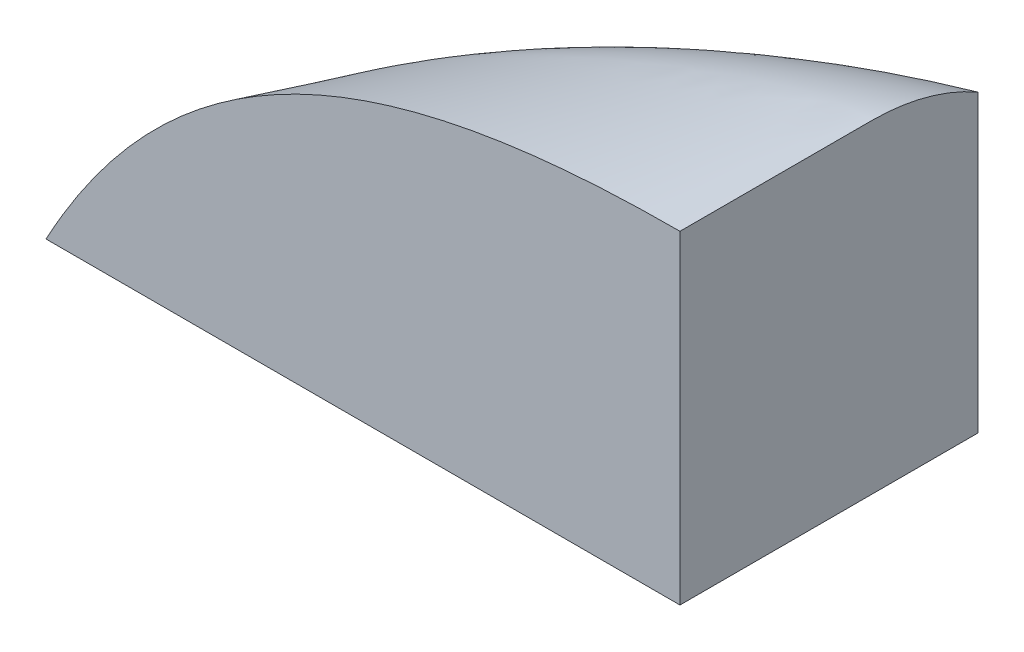
ISO-10303-21;
HEADER;
FILE_DESCRIPTION(('STEP AP214'),'2;1');
FILE_NAME('part.step','',(''),(''),'','','');
FILE_SCHEMA(('AUTOMOTIVE_DESIGN { 1 0 10303 214 1 1 1 1 }'));
ENDSEC;
DATA;
#1=APPLICATION_CONTEXT('core data for automotive mechanical design processes');
#2=APPLICATION_PROTOCOL_DEFINITION('international standard','automotive_design',2000,#1);
#3=PRODUCT_CONTEXT('',#1,'mechanical');
#4=PRODUCT('Part','Part','',(#3));
#5=PRODUCT_RELATED_PRODUCT_CATEGORY('part','',(#4));
#6=PRODUCT_DEFINITION_FORMATION('','',#4);
#7=PRODUCT_DEFINITION_CONTEXT('part definition',#1,'design');
#8=PRODUCT_DEFINITION('design','',#6,#7);
#9=PRODUCT_DEFINITION_SHAPE('','',#8);
#10=(LENGTH_UNIT() NAMED_UNIT(*) SI_UNIT(.MILLI.,.METRE.));
#11=(NAMED_UNIT(*) PLANE_ANGLE_UNIT() SI_UNIT($,.RADIAN.));
#12=(NAMED_UNIT(*) SI_UNIT($,.STERADIAN.) SOLID_ANGLE_UNIT());
#13=UNCERTAINTY_MEASURE_WITH_UNIT(LENGTH_MEASURE(1.E-05),#10,'distance_accuracy_value','');
#14=(GEOMETRIC_REPRESENTATION_CONTEXT(3) GLOBAL_UNCERTAINTY_ASSIGNED_CONTEXT((#13)) GLOBAL_UNIT_ASSIGNED_CONTEXT((#10,
#11,#12)) REPRESENTATION_CONTEXT('',''));
#15=CARTESIAN_POINT('',(0.,0.,0.));
#16=DIRECTION('',(0.,0.,1.));
#17=DIRECTION('',(1.,0.,0.));
#18=AXIS2_PLACEMENT_3D('',#15,#16,#17);
#19=CARTESIAN_POINT('',(-82.9999999999987,46.9999999999978,-104.499999999999));
#20=CARTESIAN_POINT('',(-82.9999999999965,81.4999999999957,-104.499999999672));
#21=CARTESIAN_POINT('',(-82.9999999999965,115.999999999994,-104.499999999621));
#22=CARTESIAN_POINT('',(-82.9999999999965,150.499999999992,-104.49999999957));
#23=CARTESIAN_POINT('',(-173.829365727021,46.9999999999978,-104.499999999999));
#24=CARTESIAN_POINT('',(-175.939901268627,76.2160672193664,-98.7768367889955));
#25=CARTESIAN_POINT('',(-178.050436810234,105.432134438735,-93.0536735781759));
#26=CARTESIAN_POINT('',(-180.160972351841,134.648201658104,-87.3305103673561));
#27=CARTESIAN_POINT('',(-255.676900743604,46.9999999999978,-73.6809860932464));
#28=CARTESIAN_POINT('',(-256.370700136172,66.3103367095811,-67.2982648366521));
#29=CARTESIAN_POINT('',(-257.064499528741,85.6206734191644,-60.9155435801496));
#30=CARTESIAN_POINT('',(-257.758298921309,104.931010128748,-54.532822323647));
#31=CARTESIAN_POINT('',(-305.09168004145,46.9999999999978,1.45455479258483E-11));
#32=CARTESIAN_POINT('',(-305.255585793366,46.7535479957056,1.21556949659459E-11));
#33=CARTESIAN_POINT('',(-305.419491545282,46.5070959914134,9.76584200604345E-12));
#34=CARTESIAN_POINT('',(-305.583397297199,46.2606439871212,7.37598904614104E-12));
#35=B_SPLINE_SURFACE_WITH_KNOTS('',3,3,((#19,#20,#21,#22),(#23,#24,#25,#26),(#27,#28,#29,#30),
(#31,#32,#33,#34)),.UNSPECIFIED.,.F.,.F.,.F.,(4,4),(4,4),(0.,1.),(0.,0.492904008584408),.UNSPECIFIED.);
#36=CARTESIAN_POINT('',(-82.9999999999987,46.9999999999978,-104.499999999999));
#37=CARTESIAN_POINT('',(-173.829365727021,46.9999999999978,-104.499999999999));
#38=CARTESIAN_POINT('',(-255.676900743604,46.9999999999978,-73.6809860932464));
#39=CARTESIAN_POINT('',(-305.09168004145,46.9999999999978,1.45455479258483E-11));
#40=B_SPLINE_CURVE_WITH_KNOTS('',3,(#36,#37,#38,#39),.UNSPECIFIED.,.F.,.F.,(4,4),(0.,1.),.UNSPECIFIED.);
#41=CARTESIAN_POINT('',(-82.9999999999987,46.9999999999978,-104.499999999999));
#42=VERTEX_POINT('',#41);
#43=CARTESIAN_POINT('',(-304.465944132718,46.9999999999978,-0.928171718992609));
#44=VERTEX_POINT('',#43);
#45=EDGE_CURVE('E104',#42,#44,#40,.T.);
#46=CARTESIAN_POINT('',(-304.465944132718,46.9999999999978,-0.928171718992609));
#47=CARTESIAN_POINT('',(-304.487274645418,46.9999999999978,-0.918143305819814));
#48=CARTESIAN_POINT('',(-304.508605158118,46.9999999999999,-0.908114892646524));
#49=CARTESIAN_POINT('',(-304.551266183517,47.0000000000082,-0.88805806629863));
#50=CARTESIAN_POINT('',(-304.572596696217,47.0000000000144,-0.878029653124026));
#51=CARTESIAN_POINT('',(-304.615257721617,47.000000000031,-0.857972826773481));
#52=CARTESIAN_POINT('',(-304.636588234317,47.0000000000414,-0.84794441359754));
#53=CARTESIAN_POINT('',(-304.679249259717,47.0000000000662,-0.827887587244356));
#54=CARTESIAN_POINT('',(-304.700579772417,47.0000000000807,-0.817859174067112));
#55=CARTESIAN_POINT('',(-304.743240797818,47.0000000001139,-0.797802347711282));
#56=CARTESIAN_POINT('',(-304.764571310518,47.0000000001325,-0.787773934532695));
#57=CARTESIAN_POINT('',(-304.807232335918,47.000000000174,-0.767717108174197));
#58=CARTESIAN_POINT('',(-304.828562848619,47.0000000001968,-0.757688694994286));
#59=CARTESIAN_POINT('',(-304.87122387402,47.0000000002465,-0.737631868633129));
#60=CARTESIAN_POINT('',(-304.89255438672,47.0000000002735,-0.727603455451884));
#61=CARTESIAN_POINT('',(-304.935215412121,47.0000000003315,-0.707546629088053));
#62=CARTESIAN_POINT('',(-304.956545924822,47.0000000003626,-0.697518215905466));
#63=CARTESIAN_POINT('',(-304.977876437522,47.0000000003957,-0.687489802722338));
#64=B_SPLINE_CURVE_WITH_KNOTS('',3,(#46,#47,#48,#49,#50,#51,#52,#53,#54,#55,#56,#57,#58,#59,#60,
#61,#62,#63),.UNSPECIFIED.,.F.,.F.,(4,2,2,2,2,2,2,2,4),(0.,0.0707109509572579,0.141421901916545,
0.212132852877766,0.282843803841187,0.353554754806445,0.424265705773704,0.494976656743022,
0.565687607714302),.UNSPECIFIED.);
#65=CARTESIAN_POINT('',(-304.977876437522,47.0000000003958,-0.687489802722374));
#66=VERTEX_POINT('',#65);
#67=EDGE_CURVE('E102',#44,#66,#64,.T.);
#68=CARTESIAN_POINT('',(-82.9999999999965,150.499999999992,-104.49999999957));
#69=CARTESIAN_POINT('',(-180.160972351841,134.648201658104,-87.3305103673561));
#70=CARTESIAN_POINT('',(-257.758298921309,104.931010128748,-54.532822323647));
#71=CARTESIAN_POINT('',(-305.583397297199,46.2606439871212,7.37598904614104E-12));
#72=B_SPLINE_CURVE_WITH_KNOTS('',3,(#68,#69,#70,#71),.UNSPECIFIED.,.F.,.F.,(4,4),(0.,1.),.UNSPECIFIED.);
#73=CARTESIAN_POINT('',(-82.9999999999965,150.499999999992,-104.49999999957));
#74=VERTEX_POINT('',#73);
#75=EDGE_CURVE('E87',#74,#66,#72,.T.);
#76=DIRECTION('',(0.,1.,9.46143324717752E-12));
#77=VECTOR('',#76,1.);
#78=CARTESIAN_POINT('',(-82.9999999999968,98.7499999999947,-104.499999999681));
#79=LINE('',#78,#77);
#80=EDGE_CURVE('E92',#42,#74,#79,.T.);
#81=ORIENTED_EDGE('',*,*,#45,.T.);
#82=ORIENTED_EDGE('',*,*,#67,.T.);
#83=ORIENTED_EDGE('',*,*,#75,.F.);
#84=ORIENTED_EDGE('',*,*,#80,.F.);
#85=EDGE_LOOP('',(#81,#82,#83,#84));
#86=FACE_BOUND('',#85,.T.);
#87=ADVANCED_FACE('F43',(#86),#35,.T.);
#88=CARTESIAN_POINT('',(-82.9999999999965,150.499999999992,-104.49999999957));
#89=CARTESIAN_POINT('',(-82.9999999999965,157.051493564003,-93.1187580086268));
#90=CARTESIAN_POINT('',(-82.9999999999965,160.499999999992,-80.2156284290725));
#91=CARTESIAN_POINT('',(-82.9999999999964,160.499999999992,-44.7222840878865));
#92=CARTESIAN_POINT('',(-82.9999999999965,160.499999999992,-22.3611420439435));
#93=CARTESIAN_POINT('',(-82.9999999999987,160.499999999996,0.));
#94=CARTESIAN_POINT('',(-180.160972351841,134.648201658104,-87.3305103673561));
#95=CARTESIAN_POINT('',(-180.964334081925,141.381969895503,-77.5645305744326));
#96=CARTESIAN_POINT('',(-181.767695812009,146.047080047554,-66.7839590557682));
#97=CARTESIAN_POINT('',(-183.938999137301,152.442123939295,-37.2337815946521));
#98=CARTESIAN_POINT('',(-185.306940732509,156.471061969644,-18.6168907973262));
#99=CARTESIAN_POINT('',(-186.674882327718,160.499999999996,0.));
#100=CARTESIAN_POINT('',(-257.758298921309,104.931010128748,-54.532822323647));
#101=CARTESIAN_POINT('',(-258.02238918151,110.087795568341,-48.3095333484898));
#102=CARTESIAN_POINT('',(-258.28647944171,114.21025196526,-41.5789485104622));
#103=CARTESIAN_POINT('',(-259.000255115454,122.245468494358,-23.1813373999145));
#104=CARTESIAN_POINT('',(-259.449940528996,127.307730771866,-11.5906686999573));
#105=CARTESIAN_POINT('',(-259.89962594254,132.369993049376,0.));
#106=CARTESIAN_POINT('',(-305.583397297199,46.2606439871212,7.37598904614104E-12));
#107=CARTESIAN_POINT('',(-305.645786963629,46.1668336225726,6.46630694381923E-12));
#108=CARTESIAN_POINT('',(-305.708176630059,46.0730232580241,5.55662484149742E-12));
#109=CARTESIAN_POINT('',(-305.876801653024,45.8194752623163,3.09796182611707E-12));
#110=CARTESIAN_POINT('',(-305.983037009558,45.659737631157,1.54898091305853E-12));
#111=CARTESIAN_POINT('',(-306.089272366091,45.4999999999978,0.));
#112=B_SPLINE_SURFACE_WITH_KNOTS('',3,3,((#88,#89,#90,#91,#92,#93),(#94,#95,#96,#97,#98,#99),
(#100,#101,#102,#103,#104,#105),(#106,#107,#108,#109,#110,#111)),.UNSPECIFIED.,.F.,.F.,.F.,(4,
4),(4,2,4),(0.,1.),(0.492904008584408,0.680524737681575,1.),.UNSPECIFIED.);
#113=CARTESIAN_POINT('',(-304.977876437522,47.0000000003957,-0.687489802722356));
#114=CARTESIAN_POINT('',(-304.985637758538,46.9999986355244,-0.677792674529431));
#115=CARTESIAN_POINT('',(-304.993142924931,46.9999970398599,-0.667893292732269));
#116=CARTESIAN_POINT('',(-305.00770617501,46.9999935819208,-0.647661845768081));
#117=CARTESIAN_POINT('',(-305.014760640005,46.9999917178048,-0.637327172915504));
#118=CARTESIAN_POINT('',(-305.028424533471,46.9999879302013,-0.616263437054634));
#119=CARTESIAN_POINT('',(-305.035030430688,46.9999860063852,-0.605532087645259));
#120=CARTESIAN_POINT('',(-305.04779030549,46.9999944194685,-0.583706564108082));
#121=CARTESIAN_POINT('',(-305.053940882621,47.0000048403271,-0.5726104102265));
#122=CARTESIAN_POINT('',(-305.065819610924,46.999986716677,-0.55010246845954));
#123=CARTESIAN_POINT('',(-305.071544817989,46.9999579232486,-0.538689118952203));
#124=CARTESIAN_POINT('',(-305.081437970252,47.0000343925513,-0.517707178027278));
#125=CARTESIAN_POINT('',(-305.085699364815,47.0001161337989,-0.508182340550169));
#126=CARTESIAN_POINT('',(-305.092024028118,47.0000682362617,-0.493758224906691));
#127=CARTESIAN_POINT('',(-305.094140396075,47.0000226020825,-0.488881291896832));
#128=CARTESIAN_POINT('',(-305.099906917993,46.9999605905684,-0.475483359623773));
#129=CARTESIAN_POINT('',(-305.103527337664,46.9999912034974,-0.466949358119058));
#130=CARTESIAN_POINT('',(-305.109646225613,47.0000061441316,-0.452432707854412));
#131=CARTESIAN_POINT('',(-305.112154815756,47.000001618829,-0.446454243960964));
#132=CARTESIAN_POINT('',(-305.116932284338,46.9999985217886,-0.435007505485793));
#133=CARTESIAN_POINT('',(-305.119203056432,46.9999994670332,-0.429540024685131));
#134=CARTESIAN_POINT('',(-305.126209745655,47.0000010532143,-0.412599296584759));
#135=CARTESIAN_POINT('',(-305.130918344294,47.0000002238342,-0.401114756964115));
#136=CARTESIAN_POINT('',(-305.14056318942,46.9999996662834,-0.377414909223403));
#137=CARTESIAN_POINT('',(-305.145495645843,47.0000000089098,-0.365198059992022));
#138=CARTESIAN_POINT('',(-305.154328449031,46.999999992859,-0.343174708917076));
#139=CARTESIAN_POINT('',(-305.158238891705,46.9999997601507,-0.33337225180596));
#140=CARTESIAN_POINT('',(-305.166195554226,46.9999990916497,-0.31333219198062));
#141=CARTESIAN_POINT('',(-305.17024036813,46.9999986475419,-0.303094031141507));
#142=CARTESIAN_POINT('',(-305.178465680453,46.999997750233,-0.28218206672065));
#143=CARTESIAN_POINT('',(-305.182644875485,46.999997297415,-0.271507750673743));
#144=CARTESIAN_POINT('',(-305.191138875671,46.9999965136977,-0.249723110553484));
#145=CARTESIAN_POINT('',(-305.195452470974,46.9999961883576,-0.238612314879644));
#146=CARTESIAN_POINT('',(-305.204215198812,46.999995740339,-0.215954480542485));
#147=CARTESIAN_POINT('',(-305.208663206631,46.999995625886,-0.204407007023206));
#148=CARTESIAN_POINT('',(-305.217694690862,46.9999956259594,-0.180875711708846));
#149=CARTESIAN_POINT('',(-305.222277120536,46.9999957490774,-0.168891488264916));
#150=CARTESIAN_POINT('',(-305.231577383821,46.9999961970319,-0.144486717705298));
#151=CARTESIAN_POINT('',(-305.236294242439,46.999996528881,-0.132065799119731));
#152=CARTESIAN_POINT('',(-305.245863294719,46.9999973125328,-0.106787789090908));
#153=CARTESIAN_POINT('',(-305.250714579401,46.9999977680602,-0.0939303536165877));
#154=CARTESIAN_POINT('',(-305.260552440351,46.9999986640804,-0.0677795991852909));
#155=CARTESIAN_POINT('',(-305.265538169608,46.9999991035739,-0.0544859616676196));
#156=CARTESIAN_POINT('',(-305.275644781579,46.999999773559,-0.0274631807924378));
#157=CARTESIAN_POINT('',(-305.280764871824,46.9999999968971,-0.0137337410140826));
#158=CARTESIAN_POINT('',(-305.285873382013,46.9999999999978,0.));
#159=B_SPLINE_CURVE_WITH_KNOTS('',3,(#113,#114,#115,#116,#117,#118,#119,#120,#121,#122,#123,
#124,#125,#126,#127,#128,#129,#130,#131,#132,#133,#134,#135,#136,#137,#138,#139,#140,#141,#142,
#143,#144,#145,#146,#147,#148,#149,#150,#151,#152,#153,#154,#155,#156,#157,#158),.UNSPECIFIED.,
.F.,.F.,(4,2,2,2,2,2,2,2,2,2,2,2,2,2,2,2,2,2,2,2,2,2,4),(0.,0.0372544388409021,
0.0747778226572621,0.112568715086453,0.150618115646562,0.188910170683017,0.220209203393299,
0.23615872127016,0.263968607362872,0.283418992071456,0.301179793069393,0.338416533557156,
0.377941352167246,0.409602272954551,0.442626813679296,0.477016591649943,0.51277283232219,
0.549896373142413,0.58838766672736,0.62824678352244,0.669473414046877,0.712066870811045,
0.756026089972887),.UNSPECIFIED.);
#160=CARTESIAN_POINT('',(-305.285873382013,46.9999999999978,0.));
#161=VERTEX_POINT('',#160);
#162=EDGE_CURVE('E100',#66,#161,#159,.T.);
#163=CARTESIAN_POINT('',(-82.9999999999987,160.499999999996,0.));
#164=CARTESIAN_POINT('',(-186.674882327718,160.499999999996,0.));
#165=CARTESIAN_POINT('',(-259.89962594254,132.369993049376,0.));
#166=CARTESIAN_POINT('',(-306.089272366091,45.4999999999978,0.));
#167=B_SPLINE_CURVE_WITH_KNOTS('',3,(#163,#164,#165,#166),.UNSPECIFIED.,.F.,.F.,(4,4),(0.,1.),.UNSPECIFIED.);
#168=CARTESIAN_POINT('',(-82.9999999999987,160.499999999996,0.));
#169=VERTEX_POINT('',#168);
#170=EDGE_CURVE('E89',#169,#161,#167,.T.);
#171=CARTESIAN_POINT('',(-82.9999999999965,150.499999999992,-104.49999999957));
#172=CARTESIAN_POINT('',(-82.9999999999965,157.051493564003,-93.1187580086268));
#173=CARTESIAN_POINT('',(-82.9999999999965,160.499999999992,-80.2156284290725));
#174=CARTESIAN_POINT('',(-82.9999999999964,160.499999999992,-44.7222840878865));
#175=CARTESIAN_POINT('',(-82.9999999999965,160.499999999992,-22.3611420439435));
#176=CARTESIAN_POINT('',(-82.9999999999987,160.499999999996,0.));
#177=B_SPLINE_CURVE_WITH_KNOTS('',3,(#171,#172,#173,#174,#175,#176),.UNSPECIFIED.,.F.,.F.,(4,2,
4),(0.492904008584408,0.680524737681575,1.),.UNSPECIFIED.);
#178=EDGE_CURVE('E82',#74,#169,#177,.T.);
#179=ORIENTED_EDGE('',*,*,#75,.T.);
#180=ORIENTED_EDGE('',*,*,#162,.T.);
#181=ORIENTED_EDGE('',*,*,#170,.F.);
#182=ORIENTED_EDGE('',*,*,#178,.F.);
#183=EDGE_LOOP('',(#179,#180,#181,#182));
#184=FACE_BOUND('',#183,.T.);
#185=ADVANCED_FACE('F84',(#184),#112,.T.);
#186=CARTESIAN_POINT('',(-82.9999999999965,166.999999999998,-104.49999999957));
#187=DIRECTION('',(1.,0.,0.));
#188=DIRECTION('',(0.,0.,1.));
#189=AXIS2_PLACEMENT_3D('',#186,#187,#188);
#190=PLANE('',#189);
#191=ORIENTED_EDGE('',*,*,#178,.T.);
#192=DIRECTION('',(0.,-1.,0.));
#193=VECTOR('',#192,1.);
#194=CARTESIAN_POINT('',(-82.9999999999987,166.999999999998,0.));
#195=LINE('',#194,#193);
#196=CARTESIAN_POINT('',(-82.9999999999987,46.9999999999978,0.));
#197=VERTEX_POINT('',#196);
#198=EDGE_CURVE('E11',#169,#197,#195,.T.);
#199=ORIENTED_EDGE('',*,*,#198,.T.);
#200=DIRECTION('',(0.,0.,-1.));
#201=VECTOR('',#200,1.);
#202=CARTESIAN_POINT('',(-82.9999999999965,46.9999999999978,-104.49999999957));
#203=LINE('',#202,#201);
#204=EDGE_CURVE('E95',#197,#42,#203,.T.);
#205=ORIENTED_EDGE('',*,*,#204,.T.);
#206=ORIENTED_EDGE('',*,*,#80,.T.);
#207=EDGE_LOOP('',(#191,#199,#205,#206));
#208=FACE_BOUND('',#207,.T.);
#209=ADVANCED_FACE('F45',(#208),#190,.T.);
#210=CARTESIAN_POINT('',(-82.9999999999987,166.999999999998,0.));
#211=DIRECTION('',(0.,0.,1.));
#212=DIRECTION('',(-1.,0.,0.));
#213=AXIS2_PLACEMENT_3D('',#210,#211,#212);
#214=PLANE('',#213);
#215=ORIENTED_EDGE('',*,*,#170,.T.);
#216=DIRECTION('',(1.,0.,0.));
#217=VECTOR('',#216,1.);
#218=CARTESIAN_POINT('',(-82.9999999999987,46.9999999999978,0.));
#219=LINE('',#218,#217);
#220=EDGE_CURVE('E54',#161,#197,#219,.T.);
#221=ORIENTED_EDGE('',*,*,#220,.T.);
#222=ORIENTED_EDGE('',*,*,#198,.F.);
#223=EDGE_LOOP('',(#215,#221,#222));
#224=FACE_BOUND('',#223,.T.);
#225=ADVANCED_FACE('F170',(#224),#214,.T.);
#226=CARTESIAN_POINT('',(0.,46.9999999999978,0.));
#227=DIRECTION('',(0.,1.,0.));
#228=DIRECTION('',(0.,0.,-1.));
#229=AXIS2_PLACEMENT_3D('',#226,#227,#228);
#230=PLANE('',#229);
#231=ORIENTED_EDGE('',*,*,#204,.F.);
#232=ORIENTED_EDGE('',*,*,#220,.F.);
#233=ORIENTED_EDGE('',*,*,#162,.F.);
#234=ORIENTED_EDGE('',*,*,#67,.F.);
#235=ORIENTED_EDGE('',*,*,#45,.F.);
#236=EDGE_LOOP('',(#231,#232,#233,#234,#235));
#237=FACE_BOUND('',#236,.T.);
#238=ADVANCED_FACE('F162',(#237),#230,.F.);
#239=CLOSED_SHELL('',(#87,#185,#209,#225,#238));
#240=MANIFOLD_SOLID_BREP('B2',#239);
#241=ADVANCED_BREP_SHAPE_REPRESENTATION('',(#18,#240),#14);
#242=SHAPE_DEFINITION_REPRESENTATION(#9,#241);
ENDSEC;
END-ISO-10303-21;
